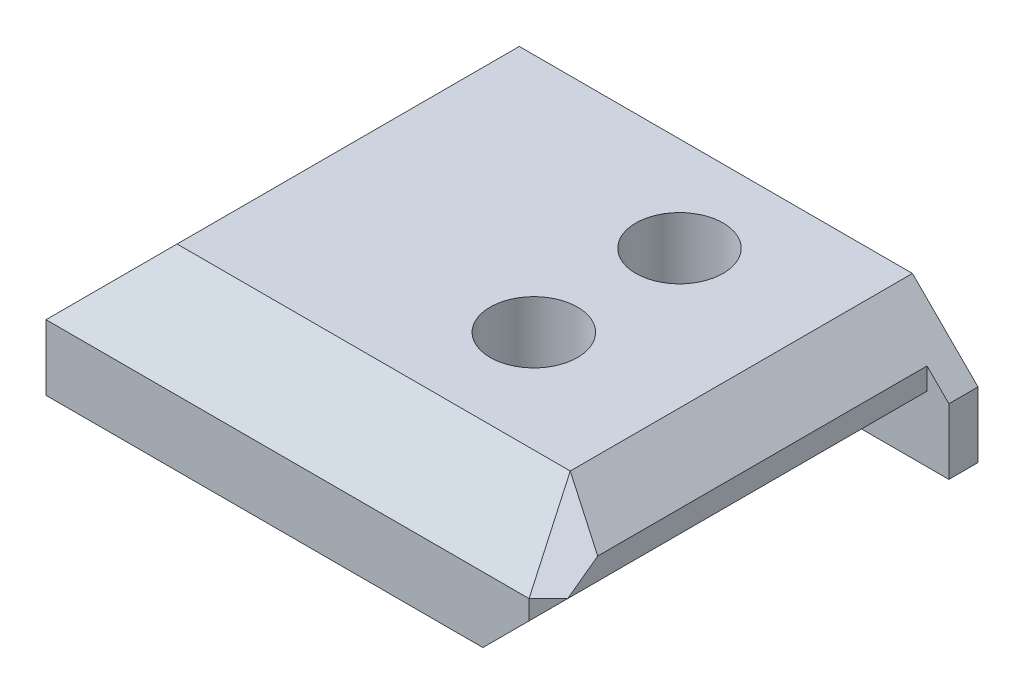
ISO-10303-21;
HEADER;
FILE_DESCRIPTION(('STEP AP214'),'2;1');
FILE_NAME('part.step','',(''),(''),'','','');
FILE_SCHEMA(('AUTOMOTIVE_DESIGN { 1 0 10303 214 1 1 1 1 }'));
ENDSEC;
DATA;
#1=APPLICATION_CONTEXT('core data for automotive mechanical design processes');
#2=APPLICATION_PROTOCOL_DEFINITION('international standard','automotive_design',2000,#1);
#3=PRODUCT_CONTEXT('',#1,'mechanical');
#4=PRODUCT('Part','Part','',(#3));
#5=PRODUCT_RELATED_PRODUCT_CATEGORY('part','',(#4));
#6=PRODUCT_DEFINITION_FORMATION('','',#4);
#7=PRODUCT_DEFINITION_CONTEXT('part definition',#1,'design');
#8=PRODUCT_DEFINITION('design','',#6,#7);
#9=PRODUCT_DEFINITION_SHAPE('','',#8);
#10=(LENGTH_UNIT() NAMED_UNIT(*) SI_UNIT(.MILLI.,.METRE.));
#11=(NAMED_UNIT(*) PLANE_ANGLE_UNIT() SI_UNIT($,.RADIAN.));
#12=(NAMED_UNIT(*) SI_UNIT($,.STERADIAN.) SOLID_ANGLE_UNIT());
#13=UNCERTAINTY_MEASURE_WITH_UNIT(LENGTH_MEASURE(1.E-05),#10,'distance_accuracy_value','');
#14=(GEOMETRIC_REPRESENTATION_CONTEXT(3) GLOBAL_UNCERTAINTY_ASSIGNED_CONTEXT((#13)) GLOBAL_UNIT_ASSIGNED_CONTEXT((#10,
#11,#12)) REPRESENTATION_CONTEXT('',''));
#15=CARTESIAN_POINT('',(0.,0.,0.));
#16=DIRECTION('',(0.,0.,1.));
#17=DIRECTION('',(1.,0.,0.));
#18=AXIS2_PLACEMENT_3D('',#15,#16,#17);
#19=CARTESIAN_POINT('',(22.,13.2426406871193,16.5));
#20=DIRECTION('',(0.,-1.,0.));
#21=DIRECTION('',(0.,0.,-1.));
#22=AXIS2_PLACEMENT_3D('',#19,#20,#21);
#23=CYLINDRICAL_SURFACE('',#22,1.5);
#24=CARTESIAN_POINT('',(22.,0.,16.5));
#25=DIRECTION('',(0.,1.,0.));
#26=DIRECTION('',(0.,0.,1.));
#27=AXIS2_PLACEMENT_3D('',#24,#25,#26);
#28=CIRCLE('',#27,1.5);
#29=CARTESIAN_POINT('',(22.,0.,18.));
#30=VERTEX_POINT('',#29);
#31=EDGE_CURVE('E332',#30,#30,#28,.T.);
#32=ORIENTED_EDGE('',*,*,#31,.F.);
#33=EDGE_LOOP('',(#32));
#34=FACE_BOUND('',#33,.T.);
#35=CARTESIAN_POINT('',(22.,2.,16.5));
#36=DIRECTION('',(0.,1.,0.));
#37=DIRECTION('',(0.,0.,1.));
#38=AXIS2_PLACEMENT_3D('',#35,#36,#37);
#39=CIRCLE('',#38,1.5);
#40=CARTESIAN_POINT('',(22.,2.,18.));
#41=VERTEX_POINT('',#40);
#42=EDGE_CURVE('E45',#41,#41,#39,.T.);
#43=ORIENTED_EDGE('',*,*,#42,.T.);
#44=EDGE_LOOP('',(#43));
#45=FACE_BOUND('',#44,.T.);
#46=ADVANCED_FACE('F41',(#34,#45),#23,.F.);
#47=CARTESIAN_POINT('',(36.,0.,28.));
#48=DIRECTION('',(0.,1.,0.));
#49=DIRECTION('',(0.,0.,1.));
#50=AXIS2_PLACEMENT_3D('',#47,#48,#49);
#51=PLANE('',#50);
#52=ORIENTED_EDGE('',*,*,#31,.T.);
#53=EDGE_LOOP('',(#52));
#54=FACE_BOUND('',#53,.T.);
#55=CARTESIAN_POINT('',(22.,0.,6.5));
#56=DIRECTION('',(0.,1.,0.));
#57=DIRECTION('',(0.,0.,1.));
#58=AXIS2_PLACEMENT_3D('',#55,#56,#57);
#59=CIRCLE('',#58,1.5);
#60=CARTESIAN_POINT('',(22.,0.,8.));
#61=VERTEX_POINT('',#60);
#62=EDGE_CURVE('E324',#61,#61,#59,.F.);
#63=ORIENTED_EDGE('',*,*,#62,.F.);
#64=EDGE_LOOP('',(#63));
#65=FACE_BOUND('',#64,.T.);
#66=DIRECTION('',(1.,0.,0.));
#67=VECTOR('',#66,1.);
#68=CARTESIAN_POINT('',(36.,0.,2.));
#69=LINE('',#68,#67);
#70=CARTESIAN_POINT('',(30.,0.,2.));
#71=VERTEX_POINT('',#70);
#72=CARTESIAN_POINT('',(36.,0.,2.));
#73=VERTEX_POINT('',#72);
#74=EDGE_CURVE('E178',#71,#73,#69,.T.);
#75=ORIENTED_EDGE('',*,*,#74,.F.);
#76=DIRECTION('',(0.,0.,1.));
#77=VECTOR('',#76,1.);
#78=CARTESIAN_POINT('',(30.,0.,2.));
#79=LINE('',#78,#77);
#80=CARTESIAN_POINT('',(30.,0.,28.));
#81=VERTEX_POINT('',#80);
#82=EDGE_CURVE('E166',#71,#81,#79,.T.);
#83=ORIENTED_EDGE('',*,*,#82,.T.);
#84=DIRECTION('',(1.,0.,0.));
#85=VECTOR('',#84,1.);
#86=CARTESIAN_POINT('',(36.,0.,28.));
#87=LINE('',#86,#85);
#88=CARTESIAN_POINT('',(0.,0.,28.));
#89=VERTEX_POINT('',#88);
#90=EDGE_CURVE('E254',#89,#81,#87,.T.);
#91=ORIENTED_EDGE('',*,*,#90,.F.);
#92=DIRECTION('',(0.,0.,-1.));
#93=VECTOR('',#92,1.);
#94=CARTESIAN_POINT('',(0.,0.,28.));
#95=LINE('',#94,#93);
#96=CARTESIAN_POINT('',(0.,0.,0.));
#97=VERTEX_POINT('',#96);
#98=EDGE_CURVE('E260',#89,#97,#95,.T.);
#99=ORIENTED_EDGE('',*,*,#98,.T.);
#100=DIRECTION('',(1.,0.,0.));
#101=VECTOR('',#100,1.);
#102=CARTESIAN_POINT('',(36.,0.,0.));
#103=LINE('',#102,#101);
#104=CARTESIAN_POINT('',(5.,0.,0.));
#105=VERTEX_POINT('',#104);
#106=EDGE_CURVE('E261',#97,#105,#103,.T.);
#107=ORIENTED_EDGE('',*,*,#106,.T.);
#108=DIRECTION('',(0.,0.,-1.));
#109=VECTOR('',#108,1.);
#110=CARTESIAN_POINT('',(5.,0.,26.));
#111=LINE('',#110,#109);
#112=CARTESIAN_POINT('',(5.,0.,26.));
#113=VERTEX_POINT('',#112);
#114=EDGE_CURVE('E65',#113,#105,#111,.T.);
#115=ORIENTED_EDGE('',*,*,#114,.F.);
#116=DIRECTION('',(1.,0.,0.));
#117=VECTOR('',#116,1.);
#118=CARTESIAN_POINT('',(5.,0.,26.));
#119=LINE('',#118,#117);
#120=CARTESIAN_POINT('',(13.8116308862596,0.,26.));
#121=VERTEX_POINT('',#120);
#122=EDGE_CURVE('E186',#113,#121,#119,.T.);
#123=ORIENTED_EDGE('',*,*,#122,.T.);
#124=DIRECTION('',(0.,0.,-1.));
#125=VECTOR('',#124,1.);
#126=CARTESIAN_POINT('',(13.8116308862596,0.,26.));
#127=LINE('',#126,#125);
#128=CARTESIAN_POINT('',(13.8116308862596,0.,0.));
#129=VERTEX_POINT('',#128);
#130=EDGE_CURVE('E221',#121,#129,#127,.T.);
#131=ORIENTED_EDGE('',*,*,#130,.T.);
#132=CARTESIAN_POINT('',(36.,0.,0.));
#133=VERTEX_POINT('',#132);
#134=EDGE_CURVE('E248',#129,#133,#103,.T.);
#135=ORIENTED_EDGE('',*,*,#134,.T.);
#136=DIRECTION('',(0.,0.,-1.));
#137=VECTOR('',#136,1.);
#138=CARTESIAN_POINT('',(36.,0.,28.));
#139=LINE('',#138,#137);
#140=EDGE_CURVE('E273',#73,#133,#139,.T.);
#141=ORIENTED_EDGE('',*,*,#140,.F.);
#142=EDGE_LOOP('',(#75,#83,#91,#99,#107,#115,#123,#131,#135,#141));
#143=FACE_BOUND('',#142,.T.);
#144=ADVANCED_FACE('F43',(#54,#65,#143),#51,.F.);
#145=CARTESIAN_POINT('',(0.,0.,0.));
#146=DIRECTION('',(0.,0.,-1.));
#147=DIRECTION('',(-1.,0.,0.));
#148=AXIS2_PLACEMENT_3D('',#145,#146,#147);
#149=PLANE('',#148);
#150=ORIENTED_EDGE('',*,*,#134,.F.);
#151=DIRECTION('',(0.,1.,0.));
#152=VECTOR('',#151,1.);
#153=CARTESIAN_POINT('',(13.8116308862596,0.,0.));
#154=LINE('',#153,#152);
#155=CARTESIAN_POINT('',(13.8116308862596,3.,0.));
#156=VERTEX_POINT('',#155);
#157=EDGE_CURVE('E185',#129,#156,#154,.T.);
#158=ORIENTED_EDGE('',*,*,#157,.T.);
#159=DIRECTION('',(-0.707106781186551,0.707106781186544,0.));
#160=VECTOR('',#159,1.);
#161=CARTESIAN_POINT('',(13.8116308862596,3.,0.));
#162=LINE('',#161,#160);
#163=CARTESIAN_POINT('',(13.104524105073,3.70710678118655,0.));
#164=VERTEX_POINT('',#163);
#165=EDGE_CURVE('E202',#156,#164,#162,.T.);
#166=ORIENTED_EDGE('',*,*,#165,.T.);
#167=DIRECTION('',(-1.,0.,0.));
#168=VECTOR('',#167,1.);
#169=CARTESIAN_POINT('',(5.70710678118655,3.70710678118655,0.));
#170=LINE('',#169,#168);
#171=CARTESIAN_POINT('',(5.70710678118655,3.70710678118655,0.));
#172=VERTEX_POINT('',#171);
#173=EDGE_CURVE('E205',#164,#172,#170,.T.);
#174=ORIENTED_EDGE('',*,*,#173,.T.);
#175=DIRECTION('',(-0.707106781186547,-0.707106781186547,0.));
#176=VECTOR('',#175,1.);
#177=CARTESIAN_POINT('',(5.,3.,0.));
#178=LINE('',#177,#176);
#179=CARTESIAN_POINT('',(5.,3.,0.));
#180=VERTEX_POINT('',#179);
#181=EDGE_CURVE('E208',#172,#180,#178,.T.);
#182=ORIENTED_EDGE('',*,*,#181,.T.);
#183=DIRECTION('',(0.,-1.,0.));
#184=VECTOR('',#183,1.);
#185=CARTESIAN_POINT('',(5.,0.,0.));
#186=LINE('',#185,#184);
#187=EDGE_CURVE('E190',#180,#105,#186,.T.);
#188=ORIENTED_EDGE('',*,*,#187,.T.);
#189=ORIENTED_EDGE('',*,*,#106,.F.);
#190=DIRECTION('',(0.,-1.,0.));
#191=VECTOR('',#190,1.);
#192=CARTESIAN_POINT('',(0.,0.,0.));
#193=LINE('',#192,#191);
#194=CARTESIAN_POINT('',(0.,4.5,0.));
#195=VERTEX_POINT('',#194);
#196=EDGE_CURVE('E258',#195,#97,#193,.T.);
#197=ORIENTED_EDGE('',*,*,#196,.F.);
#198=DIRECTION('',(0.707106781186546,0.707106781186549,0.));
#199=VECTOR('',#198,1.);
#200=CARTESIAN_POINT('',(0.,4.5,0.));
#201=LINE('',#200,#199);
#202=CARTESIAN_POINT('',(4.49999999999998,9.,0.));
#203=VERTEX_POINT('',#202);
#204=EDGE_CURVE('E239',#195,#203,#201,.T.);
#205=ORIENTED_EDGE('',*,*,#204,.T.);
#206=DIRECTION('',(-1.,0.,0.));
#207=VECTOR('',#206,1.);
#208=CARTESIAN_POINT('',(0.,9.,0.));
#209=LINE('',#208,#207);
#210=CARTESIAN_POINT('',(31.5,9.,0.));
#211=VERTEX_POINT('',#210);
#212=EDGE_CURVE('E267',#211,#203,#209,.T.);
#213=ORIENTED_EDGE('',*,*,#212,.F.);
#214=DIRECTION('',(0.707106781186546,-0.707106781186549,0.));
#215=VECTOR('',#214,1.);
#216=CARTESIAN_POINT('',(36.,4.5,0.));
#217=LINE('',#216,#215);
#218=CARTESIAN_POINT('',(36.,4.50000000000001,0.));
#219=VERTEX_POINT('',#218);
#220=EDGE_CURVE('E243',#211,#219,#217,.T.);
#221=ORIENTED_EDGE('',*,*,#220,.T.);
#222=DIRECTION('',(0.,1.,0.));
#223=VECTOR('',#222,1.);
#224=CARTESIAN_POINT('',(36.,9.,0.));
#225=LINE('',#224,#223);
#226=EDGE_CURVE('E264',#133,#219,#225,.T.);
#227=ORIENTED_EDGE('',*,*,#226,.F.);
#228=EDGE_LOOP('',(#150,#158,#166,#174,#182,#188,#189,#197,#205,#213,#221,#227));
#229=FACE_BOUND('',#228,.T.);
#230=ADVANCED_FACE('F300',(#229),#149,.T.);
#231=CARTESIAN_POINT('',(36.,4.5,28.));
#232=DIRECTION('',(0.707106781186549,0.707106781186547,0.));
#233=DIRECTION('',(-0.707106781186546,0.707106781186549,0.));
#234=AXIS2_PLACEMENT_3D('',#231,#232,#233);
#235=PLANE('',#234);
#236=DIRECTION('',(0.,0.,1.));
#237=VECTOR('',#236,1.);
#238=CARTESIAN_POINT('',(34.5,5.99999999999998,2.));
#239=LINE('',#238,#237);
#240=CARTESIAN_POINT('',(34.5,5.99999999999998,2.));
#241=VERTEX_POINT('',#240);
#242=CARTESIAN_POINT('',(34.5,5.99999999999998,24.6143819168359));
#243=VERTEX_POINT('',#242);
#244=EDGE_CURVE('E57',#241,#243,#239,.T.);
#245=ORIENTED_EDGE('',*,*,#244,.F.);
#246=DIRECTION('',(-0.707106781186546,0.707106781186549,0.));
#247=VECTOR('',#246,1.);
#248=CARTESIAN_POINT('',(36.,4.5,2.));
#249=LINE('',#248,#247);
#250=CARTESIAN_POINT('',(36.,4.50000000000001,2.));
#251=VERTEX_POINT('',#250);
#252=EDGE_CURVE('E157',#251,#241,#249,.T.);
#253=ORIENTED_EDGE('',*,*,#252,.F.);
#254=DIRECTION('',(0.,0.,-1.));
#255=VECTOR('',#254,1.);
#256=CARTESIAN_POINT('',(36.,4.5,28.));
#257=LINE('',#256,#255);
#258=EDGE_CURVE('E250',#251,#219,#257,.T.);
#259=ORIENTED_EDGE('',*,*,#258,.T.);
#260=ORIENTED_EDGE('',*,*,#220,.F.);
#261=DIRECTION('',(0.,0.,-1.));
#262=VECTOR('',#261,1.);
#263=CARTESIAN_POINT('',(31.5,9.,28.));
#264=LINE('',#263,#262);
#265=CARTESIAN_POINT('',(31.5,9.,23.5));
#266=VERTEX_POINT('',#265);
#267=EDGE_CURVE('E238',#266,#211,#264,.T.);
#268=ORIENTED_EDGE('',*,*,#267,.F.);
#269=DIRECTION('',(0.683908301776168,-0.68390830177617,0.254045014757763));
#270=VECTOR('',#269,1.);
#271=CARTESIAN_POINT('',(36.4914208129248,4.00857918707516,25.3541163644139));
#272=LINE('',#271,#270);
#273=EDGE_CURVE('E177',#266,#243,#272,.T.);
#274=ORIENTED_EDGE('',*,*,#273,.T.);
#275=EDGE_LOOP('',(#245,#253,#259,#260,#268,#274));
#276=FACE_BOUND('',#275,.T.);
#277=ADVANCED_FACE('F175',(#276),#235,.T.);
#278=CARTESIAN_POINT('',(36.,4.5,28.));
#279=DIRECTION('',(0.,0.707106781186546,0.707106781186549));
#280=DIRECTION('',(0.,-0.707106781186549,0.707106781186546));
#281=AXIS2_PLACEMENT_3D('',#278,#279,#280);
#282=PLANE('',#281);
#283=DIRECTION('',(-1.,0.,0.));
#284=VECTOR('',#283,1.);
#285=CARTESIAN_POINT('',(36.,4.5,28.));
#286=LINE('',#285,#284);
#287=CARTESIAN_POINT('',(33.1715728752538,4.5,28.));
#288=VERTEX_POINT('',#287);
#289=CARTESIAN_POINT('',(0.,4.5,28.));
#290=VERTEX_POINT('',#289);
#291=EDGE_CURVE('E236',#288,#290,#286,.T.);
#292=ORIENTED_EDGE('',*,*,#291,.F.);
#293=DIRECTION('',(-0.254045014757767,0.68390830177617,-0.683908301776167));
#294=VECTOR('',#293,1.);
#295=CARTESIAN_POINT('',(33.3541163644139,4.00857918707515,28.4914208129248));
#296=LINE('',#295,#294);
#297=EDGE_CURVE('E227',#288,#266,#296,.T.);
#298=ORIENTED_EDGE('',*,*,#297,.T.);
#299=DIRECTION('',(-1.,0.,0.));
#300=VECTOR('',#299,1.);
#301=CARTESIAN_POINT('',(36.,9.,23.5));
#302=LINE('',#301,#300);
#303=CARTESIAN_POINT('',(4.49999999999998,9.,23.5));
#304=VERTEX_POINT('',#303);
#305=EDGE_CURVE('E234',#266,#304,#302,.T.);
#306=ORIENTED_EDGE('',*,*,#305,.T.);
#307=DIRECTION('',(0.577350269189625,0.577350269189627,-0.577350269189625));
#308=VECTOR('',#307,1.);
#309=CARTESIAN_POINT('',(0.,4.5,28.));
#310=LINE('',#309,#308);
#311=EDGE_CURVE('E275',#290,#304,#310,.T.);
#312=ORIENTED_EDGE('',*,*,#311,.F.);
#313=EDGE_LOOP('',(#292,#298,#306,#312));
#314=FACE_BOUND('',#313,.T.);
#315=ADVANCED_FACE('F290',(#314),#282,.T.);
#316=CARTESIAN_POINT('',(30.585786437627,0.,30.5857864376269));
#317=DIRECTION('',(0.707106781186549,0.,0.707106781186546));
#318=DIRECTION('',(0.707106781186546,0.,-0.707106781186549));
#319=AXIS2_PLACEMENT_3D('',#316,#317,#318);
#320=PLANE('',#319);
#321=DIRECTION('',(-0.577350269189626,-0.577350269189623,0.577350269189628));
#322=VECTOR('',#321,1.);
#323=CARTESIAN_POINT('',(30.3905242917513,0.390524291751312,30.7810485835025));
#324=LINE('',#323,#322);
#325=CARTESIAN_POINT('',(34.5,4.5,26.6715728752538));
#326=VERTEX_POINT('',#325);
#327=CARTESIAN_POINT('',(33.1715728752538,3.17157287525381,28.));
#328=VERTEX_POINT('',#327);
#329=EDGE_CURVE('E165',#326,#328,#324,.T.);
#330=ORIENTED_EDGE('',*,*,#329,.F.);
#331=DIRECTION('',(0.707106781186546,0.,-0.707106781186549));
#332=VECTOR('',#331,1.);
#333=CARTESIAN_POINT('',(33.1715728752538,4.5,28.));
#334=LINE('',#333,#332);
#335=EDGE_CURVE('E224',#288,#326,#334,.T.);
#336=ORIENTED_EDGE('',*,*,#335,.F.);
#337=DIRECTION('',(0.,-1.,0.));
#338=VECTOR('',#337,1.);
#339=CARTESIAN_POINT('',(33.1715728752538,0.,28.));
#340=LINE('',#339,#338);
#341=EDGE_CURVE('E231',#288,#328,#340,.T.);
#342=ORIENTED_EDGE('',*,*,#341,.T.);
#343=EDGE_LOOP('',(#330,#336,#342));
#344=FACE_BOUND('',#343,.T.);
#345=ADVANCED_FACE('F284',(#344),#320,.T.);
#346=CARTESIAN_POINT('',(0.,0.,28.));
#347=DIRECTION('',(0.,0.,-1.));
#348=DIRECTION('',(-1.,0.,0.));
#349=AXIS2_PLACEMENT_3D('',#346,#347,#348);
#350=PLANE('',#349);
#351=ORIENTED_EDGE('',*,*,#90,.T.);
#352=DIRECTION('',(0.70710678118655,0.707106781186545,0.));
#353=VECTOR('',#352,1.);
#354=CARTESIAN_POINT('',(14.9999999999999,-15.,28.));
#355=LINE('',#354,#353);
#356=EDGE_CURVE('E11',#81,#328,#355,.T.);
#357=ORIENTED_EDGE('',*,*,#356,.T.);
#358=ORIENTED_EDGE('',*,*,#341,.F.);
#359=ORIENTED_EDGE('',*,*,#291,.T.);
#360=DIRECTION('',(0.,-1.,0.));
#361=VECTOR('',#360,1.);
#362=CARTESIAN_POINT('',(0.,0.,28.));
#363=LINE('',#362,#361);
#364=EDGE_CURVE('E257',#290,#89,#363,.T.);
#365=ORIENTED_EDGE('',*,*,#364,.T.);
#366=EDGE_LOOP('',(#351,#357,#358,#359,#365));
#367=FACE_BOUND('',#366,.T.);
#368=ADVANCED_FACE('F312',(#367),#350,.F.);
#369=CARTESIAN_POINT('',(36.,9.,28.));
#370=DIRECTION('',(-1.,0.,0.));
#371=DIRECTION('',(0.,0.,1.));
#372=AXIS2_PLACEMENT_3D('',#369,#370,#371);
#373=PLANE('',#372);
#374=ORIENTED_EDGE('',*,*,#258,.F.);
#375=DIRECTION('',(0.,1.,0.));
#376=VECTOR('',#375,1.);
#377=CARTESIAN_POINT('',(36.,5.99999999999998,2.));
#378=LINE('',#377,#376);
#379=EDGE_CURVE('E162',#73,#251,#378,.T.);
#380=ORIENTED_EDGE('',*,*,#379,.F.);
#381=ORIENTED_EDGE('',*,*,#140,.T.);
#382=ORIENTED_EDGE('',*,*,#226,.T.);
#383=EDGE_LOOP('',(#374,#380,#381,#382));
#384=FACE_BOUND('',#383,.T.);
#385=ADVANCED_FACE('F418',(#384),#373,.F.);
#386=CARTESIAN_POINT('',(0.,9.,28.));
#387=DIRECTION('',(0.,-1.,0.));
#388=DIRECTION('',(0.,0.,-1.));
#389=AXIS2_PLACEMENT_3D('',#386,#387,#388);
#390=PLANE('',#389);
#391=CARTESIAN_POINT('',(22.,9.,16.5));
#392=DIRECTION('',(0.,1.,0.));
#393=DIRECTION('',(0.,0.,1.));
#394=AXIS2_PLACEMENT_3D('',#391,#392,#393);
#395=CIRCLE('',#394,3.);
#396=CARTESIAN_POINT('',(22.,9.,19.5));
#397=VERTEX_POINT('',#396);
#398=EDGE_CURVE('E335',#397,#397,#395,.T.);
#399=ORIENTED_EDGE('',*,*,#398,.F.);
#400=EDGE_LOOP('',(#399));
#401=FACE_BOUND('',#400,.T.);
#402=CARTESIAN_POINT('',(22.,9.,6.5));
#403=DIRECTION('',(0.,1.,0.));
#404=DIRECTION('',(0.,0.,1.));
#405=AXIS2_PLACEMENT_3D('',#402,#403,#404);
#406=CIRCLE('',#405,3.);
#407=CARTESIAN_POINT('',(22.,9.,9.5));
#408=VERTEX_POINT('',#407);
#409=EDGE_CURVE('E321',#408,#408,#406,.T.);
#410=ORIENTED_EDGE('',*,*,#409,.F.);
#411=EDGE_LOOP('',(#410));
#412=FACE_BOUND('',#411,.T.);
#413=ORIENTED_EDGE('',*,*,#305,.F.);
#414=ORIENTED_EDGE('',*,*,#267,.T.);
#415=ORIENTED_EDGE('',*,*,#212,.T.);
#416=DIRECTION('',(0.,0.,-1.));
#417=VECTOR('',#416,1.);
#418=CARTESIAN_POINT('',(4.49999999999998,9.,28.));
#419=LINE('',#418,#417);
#420=EDGE_CURVE('E242',#304,#203,#419,.T.);
#421=ORIENTED_EDGE('',*,*,#420,.F.);
#422=EDGE_LOOP('',(#413,#414,#415,#421));
#423=FACE_BOUND('',#422,.T.);
#424=ADVANCED_FACE('F294',(#401,#412,#423),#390,.F.);
#425=CARTESIAN_POINT('',(0.,4.5,28.));
#426=DIRECTION('',(-0.707106781186549,0.707106781186546,0.));
#427=DIRECTION('',(-0.707106781186546,-0.707106781186549,0.));
#428=AXIS2_PLACEMENT_3D('',#425,#426,#427);
#429=PLANE('',#428);
#430=DIRECTION('',(0.,0.,-1.));
#431=VECTOR('',#430,1.);
#432=CARTESIAN_POINT('',(0.,4.5,28.));
#433=LINE('',#432,#431);
#434=EDGE_CURVE('E245',#290,#195,#433,.T.);
#435=ORIENTED_EDGE('',*,*,#434,.F.);
#436=ORIENTED_EDGE('',*,*,#311,.T.);
#437=ORIENTED_EDGE('',*,*,#420,.T.);
#438=ORIENTED_EDGE('',*,*,#204,.F.);
#439=EDGE_LOOP('',(#435,#436,#437,#438));
#440=FACE_BOUND('',#439,.T.);
#441=ADVANCED_FACE('F305',(#440),#429,.T.);
#442=CARTESIAN_POINT('',(0.,0.,28.));
#443=DIRECTION('',(1.,0.,0.));
#444=DIRECTION('',(0.,0.,-1.));
#445=AXIS2_PLACEMENT_3D('',#442,#443,#444);
#446=PLANE('',#445);
#447=ORIENTED_EDGE('',*,*,#434,.T.);
#448=ORIENTED_EDGE('',*,*,#196,.T.);
#449=ORIENTED_EDGE('',*,*,#98,.F.);
#450=ORIENTED_EDGE('',*,*,#364,.F.);
#451=EDGE_LOOP('',(#447,#448,#449,#450));
#452=FACE_BOUND('',#451,.T.);
#453=ADVANCED_FACE('F308',(#452),#446,.F.);
#454=CARTESIAN_POINT('',(30.0857864376269,9.00000000000001,24.9142135623731));
#455=DIRECTION('',(0.507613933017222,0.696172528913327,0.507613933017219));
#456=DIRECTION('',(-0.808014088376717,0.589163163295826,0.));
#457=AXIS2_PLACEMENT_3D('',#454,#455,#456);
#458=PLANE('',#457);
#459=DIRECTION('',(0.,-0.589163163295823,0.808014088376719));
#460=VECTOR('',#459,1.);
#461=CARTESIAN_POINT('',(34.5,6.89860420356718,23.3819816216527));
#462=LINE('',#461,#460);
#463=EDGE_CURVE('E50',#243,#326,#462,.T.);
#464=ORIENTED_EDGE('',*,*,#463,.F.);
#465=ORIENTED_EDGE('',*,*,#273,.F.);
#466=ORIENTED_EDGE('',*,*,#297,.F.);
#467=ORIENTED_EDGE('',*,*,#335,.T.);
#468=EDGE_LOOP('',(#464,#465,#466,#467));
#469=FACE_BOUND('',#468,.T.);
#470=ADVANCED_FACE('F286',(#469),#458,.T.);
#471=CARTESIAN_POINT('',(13.8116308862596,0.,26.));
#472=DIRECTION('',(-1.,0.,0.));
#473=DIRECTION('',(0.,0.,1.));
#474=AXIS2_PLACEMENT_3D('',#471,#472,#473);
#475=PLANE('',#474);
#476=ORIENTED_EDGE('',*,*,#157,.F.);
#477=ORIENTED_EDGE('',*,*,#130,.F.);
#478=DIRECTION('',(0.,1.,0.));
#479=VECTOR('',#478,1.);
#480=CARTESIAN_POINT('',(13.8116308862596,0.,26.));
#481=LINE('',#480,#479);
#482=CARTESIAN_POINT('',(13.8116308862596,3.,26.));
#483=VERTEX_POINT('',#482);
#484=EDGE_CURVE('E189',#121,#483,#481,.T.);
#485=ORIENTED_EDGE('',*,*,#484,.T.);
#486=DIRECTION('',(0.,0.,-1.));
#487=VECTOR('',#486,1.);
#488=CARTESIAN_POINT('',(13.8116308862596,3.,26.));
#489=LINE('',#488,#487);
#490=EDGE_CURVE('E219',#483,#156,#489,.T.);
#491=ORIENTED_EDGE('',*,*,#490,.T.);
#492=EDGE_LOOP('',(#476,#477,#485,#491));
#493=FACE_BOUND('',#492,.T.);
#494=ADVANCED_FACE('F401',(#493),#475,.T.);
#495=CARTESIAN_POINT('',(13.8116308862596,3.,26.));
#496=DIRECTION('',(-0.707106781186544,-0.707106781186551,0.));
#497=DIRECTION('',(0.707106781186551,-0.707106781186544,0.));
#498=AXIS2_PLACEMENT_3D('',#495,#496,#497);
#499=PLANE('',#498);
#500=ORIENTED_EDGE('',*,*,#165,.F.);
#501=ORIENTED_EDGE('',*,*,#490,.F.);
#502=DIRECTION('',(-0.707106781186551,0.707106781186544,0.));
#503=VECTOR('',#502,1.);
#504=CARTESIAN_POINT('',(13.8116308862596,3.,26.));
#505=LINE('',#504,#503);
#506=CARTESIAN_POINT('',(13.104524105073,3.70710678118655,26.));
#507=VERTEX_POINT('',#506);
#508=EDGE_CURVE('E192',#483,#507,#505,.T.);
#509=ORIENTED_EDGE('',*,*,#508,.T.);
#510=DIRECTION('',(0.,0.,-1.));
#511=VECTOR('',#510,1.);
#512=CARTESIAN_POINT('',(13.104524105073,3.70710678118655,26.));
#513=LINE('',#512,#511);
#514=EDGE_CURVE('E217',#507,#164,#513,.T.);
#515=ORIENTED_EDGE('',*,*,#514,.T.);
#516=EDGE_LOOP('',(#500,#501,#509,#515));
#517=FACE_BOUND('',#516,.T.);
#518=ADVANCED_FACE('F397',(#517),#499,.T.);
#519=CARTESIAN_POINT('',(5.70710678118655,3.70710678118655,26.));
#520=DIRECTION('',(0.,-1.,0.));
#521=DIRECTION('',(0.,0.,-1.));
#522=AXIS2_PLACEMENT_3D('',#519,#520,#521);
#523=PLANE('',#522);
#524=ORIENTED_EDGE('',*,*,#173,.F.);
#525=ORIENTED_EDGE('',*,*,#514,.F.);
#526=DIRECTION('',(-1.,0.,0.));
#527=VECTOR('',#526,1.);
#528=CARTESIAN_POINT('',(5.70710678118655,3.70710678118655,26.));
#529=LINE('',#528,#527);
#530=CARTESIAN_POINT('',(5.70710678118655,3.70710678118655,26.));
#531=VERTEX_POINT('',#530);
#532=EDGE_CURVE('E194',#507,#531,#529,.T.);
#533=ORIENTED_EDGE('',*,*,#532,.T.);
#534=DIRECTION('',(0.,0.,-1.));
#535=VECTOR('',#534,1.);
#536=CARTESIAN_POINT('',(5.70710678118655,3.70710678118655,26.));
#537=LINE('',#536,#535);
#538=EDGE_CURVE('E215',#531,#172,#537,.T.);
#539=ORIENTED_EDGE('',*,*,#538,.T.);
#540=EDGE_LOOP('',(#524,#525,#533,#539));
#541=FACE_BOUND('',#540,.T.);
#542=ADVANCED_FACE('F393',(#541),#523,.T.);
#543=CARTESIAN_POINT('',(5.,3.,26.));
#544=DIRECTION('',(0.707106781186548,-0.707106781186548,0.));
#545=DIRECTION('',(0.707106781186548,0.707106781186548,0.));
#546=AXIS2_PLACEMENT_3D('',#543,#544,#545);
#547=PLANE('',#546);
#548=ORIENTED_EDGE('',*,*,#181,.F.);
#549=ORIENTED_EDGE('',*,*,#538,.F.);
#550=DIRECTION('',(-0.707106781186547,-0.707106781186547,0.));
#551=VECTOR('',#550,1.);
#552=CARTESIAN_POINT('',(5.,3.,26.));
#553=LINE('',#552,#551);
#554=CARTESIAN_POINT('',(5.,3.,26.));
#555=VERTEX_POINT('',#554);
#556=EDGE_CURVE('E196',#531,#555,#553,.T.);
#557=ORIENTED_EDGE('',*,*,#556,.T.);
#558=DIRECTION('',(0.,0.,-1.));
#559=VECTOR('',#558,1.);
#560=CARTESIAN_POINT('',(5.,3.,26.));
#561=LINE('',#560,#559);
#562=EDGE_CURVE('E213',#555,#180,#561,.T.);
#563=ORIENTED_EDGE('',*,*,#562,.T.);
#564=EDGE_LOOP('',(#548,#549,#557,#563));
#565=FACE_BOUND('',#564,.T.);
#566=ADVANCED_FACE('F390',(#565),#547,.T.);
#567=CARTESIAN_POINT('',(5.,0.,26.));
#568=DIRECTION('',(1.,0.,0.));
#569=DIRECTION('',(0.,0.,-1.));
#570=AXIS2_PLACEMENT_3D('',#567,#568,#569);
#571=PLANE('',#570);
#572=ORIENTED_EDGE('',*,*,#187,.F.);
#573=ORIENTED_EDGE('',*,*,#562,.F.);
#574=DIRECTION('',(0.,-1.,0.));
#575=VECTOR('',#574,1.);
#576=CARTESIAN_POINT('',(5.,0.,26.));
#577=LINE('',#576,#575);
#578=EDGE_CURVE('E198',#555,#113,#577,.T.);
#579=ORIENTED_EDGE('',*,*,#578,.T.);
#580=ORIENTED_EDGE('',*,*,#114,.T.);
#581=EDGE_LOOP('',(#572,#573,#579,#580));
#582=FACE_BOUND('',#581,.T.);
#583=ADVANCED_FACE('F386',(#582),#571,.T.);
#584=CARTESIAN_POINT('',(0.,0.,26.));
#585=DIRECTION('',(0.,0.,1.));
#586=DIRECTION('',(1.,0.,0.));
#587=AXIS2_PLACEMENT_3D('',#584,#585,#586);
#588=PLANE('',#587);
#589=ORIENTED_EDGE('',*,*,#122,.F.);
#590=ORIENTED_EDGE('',*,*,#578,.F.);
#591=ORIENTED_EDGE('',*,*,#556,.F.);
#592=ORIENTED_EDGE('',*,*,#532,.F.);
#593=ORIENTED_EDGE('',*,*,#508,.F.);
#594=ORIENTED_EDGE('',*,*,#484,.F.);
#595=EDGE_LOOP('',(#589,#590,#591,#592,#593,#594));
#596=FACE_BOUND('',#595,.T.);
#597=ADVANCED_FACE('F381',(#596),#588,.F.);
#598=CARTESIAN_POINT('',(34.5,4.5,2.));
#599=DIRECTION('',(-0.707106781186545,0.70710678118655,0.));
#600=DIRECTION('',(-0.70710678118655,-0.707106781186545,0.));
#601=AXIS2_PLACEMENT_3D('',#598,#599,#600);
#602=PLANE('',#601);
#603=ORIENTED_EDGE('',*,*,#329,.T.);
#604=ORIENTED_EDGE('',*,*,#356,.F.);
#605=ORIENTED_EDGE('',*,*,#82,.F.);
#606=DIRECTION('',(-0.70710678118655,-0.707106781186545,0.));
#607=VECTOR('',#606,1.);
#608=CARTESIAN_POINT('',(34.5,4.5,2.));
#609=LINE('',#608,#607);
#610=CARTESIAN_POINT('',(34.5,4.5,2.));
#611=VERTEX_POINT('',#610);
#612=EDGE_CURVE('E172',#611,#71,#609,.T.);
#613=ORIENTED_EDGE('',*,*,#612,.F.);
#614=DIRECTION('',(0.,0.,1.));
#615=VECTOR('',#614,1.);
#616=CARTESIAN_POINT('',(34.5,4.5,2.));
#617=LINE('',#616,#615);
#618=EDGE_CURVE('E170',#611,#326,#617,.T.);
#619=ORIENTED_EDGE('',*,*,#618,.T.);
#620=EDGE_LOOP('',(#603,#604,#605,#613,#619));
#621=FACE_BOUND('',#620,.T.);
#622=ADVANCED_FACE('F281',(#621),#602,.F.);
#623=CARTESIAN_POINT('',(34.5,4.5,2.));
#624=DIRECTION('',(-1.,0.,0.));
#625=DIRECTION('',(0.,0.,1.));
#626=AXIS2_PLACEMENT_3D('',#623,#624,#625);
#627=PLANE('',#626);
#628=ORIENTED_EDGE('',*,*,#463,.T.);
#629=ORIENTED_EDGE('',*,*,#618,.F.);
#630=DIRECTION('',(0.,-1.,0.));
#631=VECTOR('',#630,1.);
#632=CARTESIAN_POINT('',(34.5,4.5,2.));
#633=LINE('',#632,#631);
#634=EDGE_CURVE('E160',#241,#611,#633,.T.);
#635=ORIENTED_EDGE('',*,*,#634,.F.);
#636=ORIENTED_EDGE('',*,*,#244,.T.);
#637=EDGE_LOOP('',(#628,#629,#635,#636));
#638=FACE_BOUND('',#637,.T.);
#639=ADVANCED_FACE('F168',(#638),#627,.F.);
#640=CARTESIAN_POINT('',(0.,0.,2.));
#641=DIRECTION('',(0.,0.,-1.));
#642=DIRECTION('',(-1.,0.,0.));
#643=AXIS2_PLACEMENT_3D('',#640,#641,#642);
#644=PLANE('',#643);
#645=ORIENTED_EDGE('',*,*,#252,.T.);
#646=ORIENTED_EDGE('',*,*,#634,.T.);
#647=ORIENTED_EDGE('',*,*,#612,.T.);
#648=ORIENTED_EDGE('',*,*,#74,.T.);
#649=ORIENTED_EDGE('',*,*,#379,.T.);
#650=EDGE_LOOP('',(#645,#646,#647,#648,#649));
#651=FACE_BOUND('',#650,.T.);
#652=ADVANCED_FACE('F158',(#651),#644,.F.);
#653=CARTESIAN_POINT('',(22.,2.,6.5));
#654=DIRECTION('',(0.,1.,0.));
#655=DIRECTION('',(0.,0.,1.));
#656=AXIS2_PLACEMENT_3D('',#653,#654,#655);
#657=CYLINDRICAL_SURFACE('',#656,3.);
#658=CARTESIAN_POINT('',(22.,2.,6.5));
#659=DIRECTION('',(0.,1.,0.));
#660=DIRECTION('',(0.,0.,1.));
#661=AXIS2_PLACEMENT_3D('',#658,#659,#660);
#662=CIRCLE('',#661,3.);
#663=CARTESIAN_POINT('',(22.,2.,9.5));
#664=VERTEX_POINT('',#663);
#665=EDGE_CURVE('E320',#664,#664,#662,.T.);
#666=ORIENTED_EDGE('',*,*,#665,.F.);
#667=EDGE_LOOP('',(#666));
#668=FACE_BOUND('',#667,.T.);
#669=ORIENTED_EDGE('',*,*,#409,.T.);
#670=EDGE_LOOP('',(#669));
#671=FACE_BOUND('',#670,.T.);
#672=ADVANCED_FACE('F372',(#668,#671),#657,.F.);
#673=CARTESIAN_POINT('',(22.,2.,6.5));
#674=DIRECTION('',(0.,1.,0.));
#675=DIRECTION('',(0.,0.,1.));
#676=AXIS2_PLACEMENT_3D('',#673,#674,#675);
#677=PLANE('',#676);
#678=CARTESIAN_POINT('',(22.,2.,6.5));
#679=DIRECTION('',(0.,1.,0.));
#680=DIRECTION('',(0.,0.,1.));
#681=AXIS2_PLACEMENT_3D('',#678,#679,#680);
#682=CIRCLE('',#681,1.5);
#683=CARTESIAN_POINT('',(22.,2.,8.));
#684=VERTEX_POINT('',#683);
#685=EDGE_CURVE('E329',#684,#684,#682,.T.);
#686=ORIENTED_EDGE('',*,*,#685,.F.);
#687=EDGE_LOOP('',(#686));
#688=FACE_BOUND('',#687,.T.);
#689=ORIENTED_EDGE('',*,*,#665,.T.);
#690=EDGE_LOOP('',(#689));
#691=FACE_BOUND('',#690,.T.);
#692=ADVANCED_FACE('F368',(#688,#691),#677,.T.);
#693=CARTESIAN_POINT('',(22.,-4.24264068711929,6.5));
#694=DIRECTION('',(0.,1.,0.));
#695=DIRECTION('',(0.,0.,1.));
#696=AXIS2_PLACEMENT_3D('',#693,#694,#695);
#697=CYLINDRICAL_SURFACE('',#696,1.5);
#698=ORIENTED_EDGE('',*,*,#62,.T.);
#699=EDGE_LOOP('',(#698));
#700=FACE_BOUND('',#699,.T.);
#701=ORIENTED_EDGE('',*,*,#685,.T.);
#702=EDGE_LOOP('',(#701));
#703=FACE_BOUND('',#702,.T.);
#704=ADVANCED_FACE('F353',(#700,#703),#697,.F.);
#705=CARTESIAN_POINT('',(22.,2.,16.5));
#706=DIRECTION('',(0.,1.,0.));
#707=DIRECTION('',(0.,0.,1.));
#708=AXIS2_PLACEMENT_3D('',#705,#706,#707);
#709=CYLINDRICAL_SURFACE('',#708,3.);
#710=CARTESIAN_POINT('',(22.,2.,16.5));
#711=DIRECTION('',(0.,1.,0.));
#712=DIRECTION('',(0.,0.,1.));
#713=AXIS2_PLACEMENT_3D('',#710,#711,#712);
#714=CIRCLE('',#713,3.);
#715=CARTESIAN_POINT('',(22.,2.,19.5));
#716=VERTEX_POINT('',#715);
#717=EDGE_CURVE('E338',#716,#716,#714,.T.);
#718=ORIENTED_EDGE('',*,*,#717,.F.);
#719=EDGE_LOOP('',(#718));
#720=FACE_BOUND('',#719,.T.);
#721=ORIENTED_EDGE('',*,*,#398,.T.);
#722=EDGE_LOOP('',(#721));
#723=FACE_BOUND('',#722,.T.);
#724=ADVANCED_FACE('F348',(#720,#723),#709,.F.);
#725=CARTESIAN_POINT('',(22.,2.,16.5));
#726=DIRECTION('',(0.,1.,0.));
#727=DIRECTION('',(0.,0.,1.));
#728=AXIS2_PLACEMENT_3D('',#725,#726,#727);
#729=PLANE('',#728);
#730=ORIENTED_EDGE('',*,*,#42,.F.);
#731=EDGE_LOOP('',(#730));
#732=FACE_BOUND('',#731,.T.);
#733=ORIENTED_EDGE('',*,*,#717,.T.);
#734=EDGE_LOOP('',(#733));
#735=FACE_BOUND('',#734,.T.);
#736=ADVANCED_FACE('F346',(#732,#735),#729,.T.);
#737=CLOSED_SHELL('',(#46,#144,#230,#277,#315,#345,#368,#385,#424,#441,#453,#470,#494,#518,#542,
#566,#583,#597,#622,#639,#652,#672,#692,#704,#724,#736));
#738=MANIFOLD_SOLID_BREP('B2',#737);
#739=ADVANCED_BREP_SHAPE_REPRESENTATION('',(#18,#738),#14);
#740=SHAPE_DEFINITION_REPRESENTATION(#9,#739);
ENDSEC;
END-ISO-10303-21;
